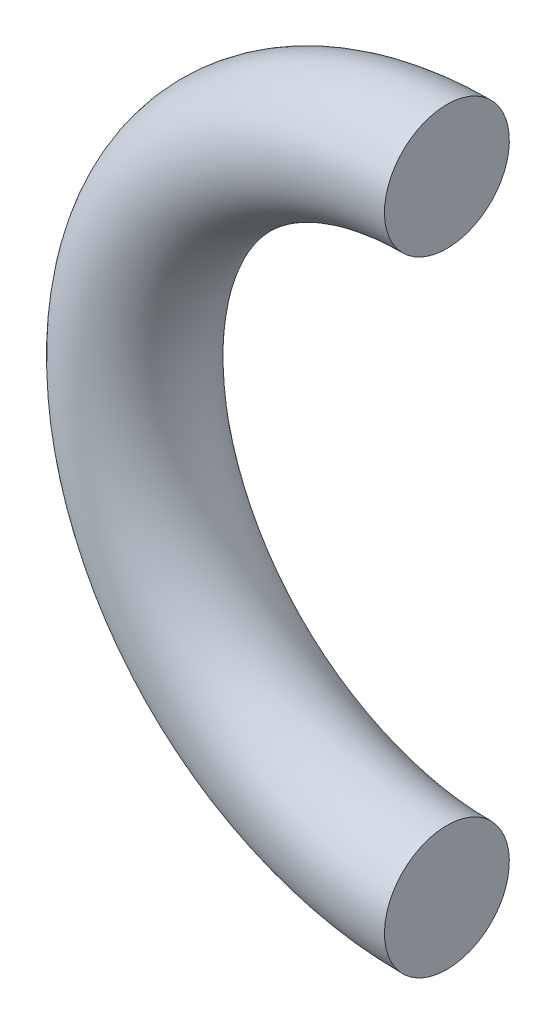
ISO-10303-21;
HEADER;
FILE_DESCRIPTION(('STEP AP214'),'2;1');
FILE_NAME('part.step','',(''),(''),'','','');
FILE_SCHEMA(('AUTOMOTIVE_DESIGN { 1 0 10303 214 1 1 1 1 }'));
ENDSEC;
DATA;
#1=APPLICATION_CONTEXT('core data for automotive mechanical design processes');
#2=APPLICATION_PROTOCOL_DEFINITION('international standard','automotive_design',2000,#1);
#3=PRODUCT_CONTEXT('',#1,'mechanical');
#4=PRODUCT('Part','Part','',(#3));
#5=PRODUCT_RELATED_PRODUCT_CATEGORY('part','',(#4));
#6=PRODUCT_DEFINITION_FORMATION('','',#4);
#7=PRODUCT_DEFINITION_CONTEXT('part definition',#1,'design');
#8=PRODUCT_DEFINITION('design','',#6,#7);
#9=PRODUCT_DEFINITION_SHAPE('','',#8);
#10=(LENGTH_UNIT() NAMED_UNIT(*) SI_UNIT(.MILLI.,.METRE.));
#11=(NAMED_UNIT(*) PLANE_ANGLE_UNIT() SI_UNIT($,.RADIAN.));
#12=(NAMED_UNIT(*) SI_UNIT($,.STERADIAN.) SOLID_ANGLE_UNIT());
#13=UNCERTAINTY_MEASURE_WITH_UNIT(LENGTH_MEASURE(1.E-05),#10,'distance_accuracy_value','');
#14=(GEOMETRIC_REPRESENTATION_CONTEXT(3) GLOBAL_UNCERTAINTY_ASSIGNED_CONTEXT((#13)) GLOBAL_UNIT_ASSIGNED_CONTEXT((#10,
#11,#12)) REPRESENTATION_CONTEXT('',''));
#15=CARTESIAN_POINT('',(0.,0.,0.));
#16=DIRECTION('',(0.,0.,1.));
#17=DIRECTION('',(1.,0.,0.));
#18=AXIS2_PLACEMENT_3D('',#15,#16,#17);
#19=CARTESIAN_POINT('',(0.,-15.875,0.));
#20=DIRECTION('',(0.,0.,-1.));
#21=DIRECTION('',(-1.,0.,0.));
#22=AXIS2_PLACEMENT_3D('',#19,#20,#21);
#23=TOROIDAL_SURFACE('',#22,15.875,3.175);
#24=CARTESIAN_POINT('',(1.10854532508269E-13,-31.75,0.));
#25=DIRECTION('',(-1.,0.,0.));
#26=DIRECTION('',(0.,0.,-1.));
#27=AXIS2_PLACEMENT_3D('',#24,#25,#26);
#28=CIRCLE('',#27,3.175);
#29=CARTESIAN_POINT('',(1.33025439009923E-13,-34.925,0.));
#30=VERTEX_POINT('',#29);
#31=EDGE_CURVE('E10',#30,#30,#28,.T.);
#32=CARTESIAN_POINT('',(0.,0.,0.));
#33=DIRECTION('',(1.,0.,0.));
#34=DIRECTION('',(0.,0.,-1.));
#35=AXIS2_PLACEMENT_3D('',#32,#33,#34);
#36=CIRCLE('',#35,3.175);
#37=CARTESIAN_POINT('',(0.,3.175,0.));
#38=VERTEX_POINT('',#37);
#39=EDGE_CURVE('E46',#38,#38,#36,.T.);
#40=CARTESIAN_POINT('',(0.,-15.875,0.));
#41=DIRECTION('',(0.,0.,-1.));
#42=DIRECTION('',(-1.,0.,0.));
#43=AXIS2_PLACEMENT_3D('',#40,#41,#42);
#44=CIRCLE('',#43,19.05);
#45=EDGE_CURVE('',#30,#38,#44,.T.);
#46=ORIENTED_EDGE('',*,*,#31,.T.);
#47=ORIENTED_EDGE('',*,*,#39,.F.);
#48=ORIENTED_EDGE('',*,*,#45,.T.);
#49=ORIENTED_EDGE('',*,*,#45,.F.);
#50=EDGE_LOOP('',(#46,#48,#47,#49));
#51=FACE_BOUND('',#50,.T.);
#52=ADVANCED_FACE('F39',(#51),#23,.T.);
#53=CARTESIAN_POINT('',(1.10854532508269E-13,-31.75,0.));
#54=DIRECTION('',(-1.,0.,0.));
#55=DIRECTION('',(0.,0.,-1.));
#56=AXIS2_PLACEMENT_3D('',#53,#54,#55);
#57=PLANE('',#56);
#58=ORIENTED_EDGE('',*,*,#31,.F.);
#59=EDGE_LOOP('',(#58));
#60=FACE_BOUND('',#59,.T.);
#61=ADVANCED_FACE('F56',(#60),#57,.F.);
#62=CARTESIAN_POINT('',(0.,0.,0.));
#63=DIRECTION('',(1.,0.,0.));
#64=DIRECTION('',(0.,0.,-1.));
#65=AXIS2_PLACEMENT_3D('',#62,#63,#64);
#66=PLANE('',#65);
#67=ORIENTED_EDGE('',*,*,#39,.T.);
#68=EDGE_LOOP('',(#67));
#69=FACE_BOUND('',#68,.T.);
#70=ADVANCED_FACE('F53',(#69),#66,.T.);
#71=CLOSED_SHELL('',(#52,#61,#70));
#72=MANIFOLD_SOLID_BREP('B2',#71);
#73=ADVANCED_BREP_SHAPE_REPRESENTATION('',(#18,#72),#14);
#74=SHAPE_DEFINITION_REPRESENTATION(#9,#73);
ENDSEC;
END-ISO-10303-21;
